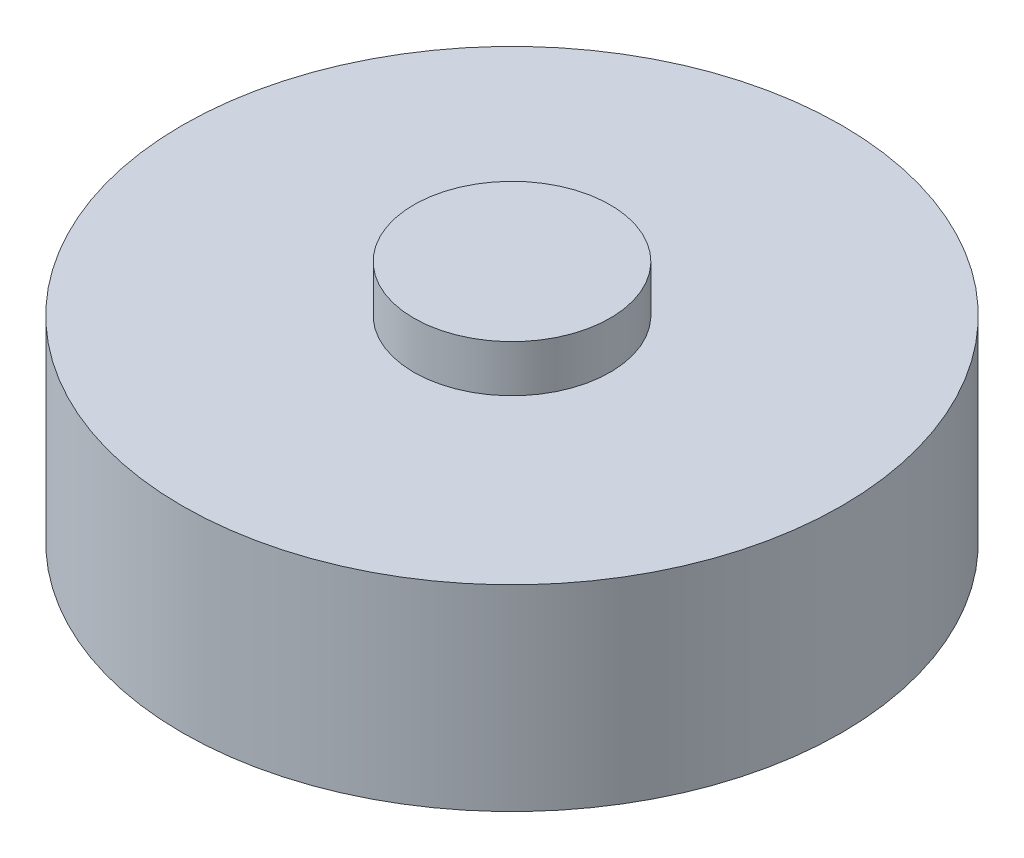
ISO-10303-21;
HEADER;
FILE_DESCRIPTION(('STEP AP214'),'2;1');
FILE_NAME('part.step','',(''),(''),'','','');
FILE_SCHEMA(('AUTOMOTIVE_DESIGN { 1 0 10303 214 1 1 1 1 }'));
ENDSEC;
DATA;
#1=APPLICATION_CONTEXT('core data for automotive mechanical design processes');
#2=APPLICATION_PROTOCOL_DEFINITION('international standard','automotive_design',2000,#1);
#3=PRODUCT_CONTEXT('',#1,'mechanical');
#4=PRODUCT('Part','Part','',(#3));
#5=PRODUCT_RELATED_PRODUCT_CATEGORY('part','',(#4));
#6=PRODUCT_DEFINITION_FORMATION('','',#4);
#7=PRODUCT_DEFINITION_CONTEXT('part definition',#1,'design');
#8=PRODUCT_DEFINITION('design','',#6,#7);
#9=PRODUCT_DEFINITION_SHAPE('','',#8);
#10=(LENGTH_UNIT() NAMED_UNIT(*) SI_UNIT(.MILLI.,.METRE.));
#11=(NAMED_UNIT(*) PLANE_ANGLE_UNIT() SI_UNIT($,.RADIAN.));
#12=(NAMED_UNIT(*) SI_UNIT($,.STERADIAN.) SOLID_ANGLE_UNIT());
#13=UNCERTAINTY_MEASURE_WITH_UNIT(LENGTH_MEASURE(1.E-05),#10,'distance_accuracy_value','');
#14=(GEOMETRIC_REPRESENTATION_CONTEXT(3) GLOBAL_UNCERTAINTY_ASSIGNED_CONTEXT((#13)) GLOBAL_UNIT_ASSIGNED_CONTEXT((#10,
#11,#12)) REPRESENTATION_CONTEXT('',''));
#15=CARTESIAN_POINT('',(0.,0.,0.));
#16=DIRECTION('',(0.,0.,1.));
#17=DIRECTION('',(1.,0.,0.));
#18=AXIS2_PLACEMENT_3D('',#15,#16,#17);
#19=CARTESIAN_POINT('',(0.,17.78,0.));
#20=DIRECTION('',(0.,-1.,0.));
#21=DIRECTION('',(0.,0.,-1.));
#22=AXIS2_PLACEMENT_3D('',#19,#20,#21);
#23=CYLINDRICAL_SURFACE('',#22,29.845);
#24=CARTESIAN_POINT('',(0.,17.78,0.));
#25=DIRECTION('',(0.,1.,0.));
#26=DIRECTION('',(0.,0.,1.));
#27=AXIS2_PLACEMENT_3D('',#24,#25,#26);
#28=CIRCLE('',#27,29.845);
#29=CARTESIAN_POINT('',(0.,17.78,29.845));
#30=VERTEX_POINT('',#29);
#31=EDGE_CURVE('E128',#30,#30,#28,.T.);
#32=ORIENTED_EDGE('',*,*,#31,.F.);
#33=EDGE_LOOP('',(#32));
#34=FACE_BOUND('',#33,.T.);
#35=CARTESIAN_POINT('',(0.,0.,0.));
#36=DIRECTION('',(0.,1.,0.));
#37=DIRECTION('',(0.,0.,1.));
#38=AXIS2_PLACEMENT_3D('',#35,#36,#37);
#39=CIRCLE('',#38,29.845);
#40=CARTESIAN_POINT('',(0.,0.,29.845));
#41=VERTEX_POINT('',#40);
#42=EDGE_CURVE('E37',#41,#41,#39,.T.);
#43=ORIENTED_EDGE('',*,*,#42,.T.);
#44=EDGE_LOOP('',(#43));
#45=FACE_BOUND('',#44,.T.);
#46=ADVANCED_FACE('F34',(#34,#45),#23,.T.);
#47=CARTESIAN_POINT('',(0.,17.78,0.));
#48=DIRECTION('',(0.,1.,0.));
#49=DIRECTION('',(0.,0.,1.));
#50=AXIS2_PLACEMENT_3D('',#47,#48,#49);
#51=PLANE('',#50);
#52=CARTESIAN_POINT('',(0.,17.78,0.));
#53=DIRECTION('',(0.,1.,0.));
#54=DIRECTION('',(0.,0.,1.));
#55=AXIS2_PLACEMENT_3D('',#52,#53,#54);
#56=CIRCLE('',#55,8.89);
#57=CARTESIAN_POINT('',(0.,17.78,8.89));
#58=VERTEX_POINT('',#57);
#59=EDGE_CURVE('E42',#58,#58,#56,.T.);
#60=ORIENTED_EDGE('',*,*,#59,.F.);
#61=EDGE_LOOP('',(#60));
#62=FACE_BOUND('',#61,.T.);
#63=ORIENTED_EDGE('',*,*,#31,.T.);
#64=EDGE_LOOP('',(#63));
#65=FACE_BOUND('',#64,.T.);
#66=ADVANCED_FACE('F139',(#62,#65),#51,.T.);
#67=CARTESIAN_POINT('',(0.,0.,0.));
#68=DIRECTION('',(0.,1.,0.));
#69=DIRECTION('',(0.,0.,1.));
#70=AXIS2_PLACEMENT_3D('',#67,#68,#69);
#71=PLANE('',#70);
#72=CARTESIAN_POINT('',(0.,0.,0.));
#73=DIRECTION('',(0.,-1.,0.));
#74=DIRECTION('',(0.,0.,-1.));
#75=AXIS2_PLACEMENT_3D('',#72,#73,#74);
#76=CIRCLE('',#75,7.493);
#77=CARTESIAN_POINT('',(0.,0.,-7.493));
#78=VERTEX_POINT('',#77);
#79=EDGE_CURVE('E11',#78,#78,#76,.T.);
#80=ORIENTED_EDGE('',*,*,#79,.F.);
#81=EDGE_LOOP('',(#80));
#82=FACE_BOUND('',#81,.T.);
#83=ORIENTED_EDGE('',*,*,#42,.F.);
#84=EDGE_LOOP('',(#83));
#85=FACE_BOUND('',#84,.T.);
#86=ADVANCED_FACE('F136',(#82,#85),#71,.F.);
#87=CARTESIAN_POINT('',(0.,22.0218,0.));
#88=DIRECTION('',(0.,-1.,0.));
#89=DIRECTION('',(0.,0.,-1.));
#90=AXIS2_PLACEMENT_3D('',#87,#88,#89);
#91=CYLINDRICAL_SURFACE('',#90,8.89);
#92=CARTESIAN_POINT('',(0.,22.0218,0.));
#93=DIRECTION('',(0.,1.,0.));
#94=DIRECTION('',(0.,0.,1.));
#95=AXIS2_PLACEMENT_3D('',#92,#93,#94);
#96=CIRCLE('',#95,8.89);
#97=CARTESIAN_POINT('',(0.,22.0218,8.89));
#98=VERTEX_POINT('',#97);
#99=EDGE_CURVE('E123',#98,#98,#96,.T.);
#100=ORIENTED_EDGE('',*,*,#99,.F.);
#101=EDGE_LOOP('',(#100));
#102=FACE_BOUND('',#101,.T.);
#103=ORIENTED_EDGE('',*,*,#59,.T.);
#104=EDGE_LOOP('',(#103));
#105=FACE_BOUND('',#104,.T.);
#106=ADVANCED_FACE('F138',(#102,#105),#91,.T.);
#107=CARTESIAN_POINT('',(0.,22.0218,0.));
#108=DIRECTION('',(0.,1.,0.));
#109=DIRECTION('',(0.,0.,1.));
#110=AXIS2_PLACEMENT_3D('',#107,#108,#109);
#111=PLANE('',#110);
#112=ORIENTED_EDGE('',*,*,#99,.T.);
#113=EDGE_LOOP('',(#112));
#114=FACE_BOUND('',#113,.T.);
#115=ADVANCED_FACE('F145',(#114),#111,.T.);
#116=CARTESIAN_POINT('',(0.,-4.064,0.));
#117=DIRECTION('',(0.,1.,0.));
#118=DIRECTION('',(0.,0.,1.));
#119=AXIS2_PLACEMENT_3D('',#116,#117,#118);
#120=CYLINDRICAL_SURFACE('',#119,7.493);
#121=CARTESIAN_POINT('',(0.,-4.064,0.));
#122=DIRECTION('',(0.,-1.,0.));
#123=DIRECTION('',(0.,0.,-1.));
#124=AXIS2_PLACEMENT_3D('',#121,#122,#123);
#125=CIRCLE('',#124,7.493);
#126=CARTESIAN_POINT('',(0.,-4.064,-7.493));
#127=VERTEX_POINT('',#126);
#128=EDGE_CURVE('E119',#127,#127,#125,.T.);
#129=ORIENTED_EDGE('',*,*,#128,.F.);
#130=EDGE_LOOP('',(#129));
#131=FACE_BOUND('',#130,.T.);
#132=ORIENTED_EDGE('',*,*,#79,.T.);
#133=EDGE_LOOP('',(#132));
#134=FACE_BOUND('',#133,.T.);
#135=ADVANCED_FACE('F189',(#131,#134),#120,.T.);
#136=CARTESIAN_POINT('',(0.,-4.826,0.));
#137=DIRECTION('',(0.,1.,0.));
#138=DIRECTION('',(0.,0.,1.));
#139=AXIS2_PLACEMENT_3D('',#136,#137,#138);
#140=CYLINDRICAL_SURFACE('',#139,8.255);
#141=CARTESIAN_POINT('',(0.,-4.826,0.));
#142=DIRECTION('',(0.,-1.,0.));
#143=DIRECTION('',(0.,0.,-1.));
#144=AXIS2_PLACEMENT_3D('',#141,#142,#143);
#145=CIRCLE('',#144,8.255);
#146=CARTESIAN_POINT('',(0.,-4.826,-8.255));
#147=VERTEX_POINT('',#146);
#148=EDGE_CURVE('E116',#147,#147,#145,.T.);
#149=ORIENTED_EDGE('',*,*,#148,.F.);
#150=EDGE_LOOP('',(#149));
#151=FACE_BOUND('',#150,.T.);
#152=CARTESIAN_POINT('',(0.,-4.064,0.));
#153=DIRECTION('',(0.,-1.,0.));
#154=DIRECTION('',(0.,0.,-1.));
#155=AXIS2_PLACEMENT_3D('',#152,#153,#154);
#156=CIRCLE('',#155,8.255);
#157=CARTESIAN_POINT('',(0.,-4.064,-8.255));
#158=VERTEX_POINT('',#157);
#159=EDGE_CURVE('E113',#158,#158,#156,.T.);
#160=ORIENTED_EDGE('',*,*,#159,.T.);
#161=EDGE_LOOP('',(#160));
#162=FACE_BOUND('',#161,.T.);
#163=ADVANCED_FACE('F178',(#151,#162),#140,.T.);
#164=CARTESIAN_POINT('',(0.,-4.826,0.));
#165=DIRECTION('',(0.,-1.,0.));
#166=DIRECTION('',(0.,0.,-1.));
#167=AXIS2_PLACEMENT_3D('',#164,#165,#166);
#168=PLANE('',#167);
#169=CARTESIAN_POINT('',(0.,-4.826,0.));
#170=DIRECTION('',(0.,-1.,0.));
#171=DIRECTION('',(0.,0.,-1.));
#172=AXIS2_PLACEMENT_3D('',#169,#170,#171);
#173=CIRCLE('',#172,2.7);
#174=CARTESIAN_POINT('',(2.33826859021798,-4.826,-1.35));
#175=VERTEX_POINT('',#174);
#176=CARTESIAN_POINT('',(2.33826859021798,-4.826,1.35));
#177=VERTEX_POINT('',#176);
#178=EDGE_CURVE('E50',#175,#177,#173,.T.);
#179=ORIENTED_EDGE('',*,*,#178,.F.);
#180=DIRECTION('',(1.,0.,0.));
#181=VECTOR('',#180,1.);
#182=CARTESIAN_POINT('',(2.33826859021798,-4.826,-1.35));
#183=LINE('',#182,#181);
#184=CARTESIAN_POINT('',(-2.33826859021798,-4.826,-1.35));
#185=VERTEX_POINT('',#184);
#186=EDGE_CURVE('E101',#185,#175,#183,.T.);
#187=ORIENTED_EDGE('',*,*,#186,.F.);
#188=CARTESIAN_POINT('',(0.,-4.826,0.));
#189=DIRECTION('',(0.,-1.,0.));
#190=DIRECTION('',(0.,0.,-1.));
#191=AXIS2_PLACEMENT_3D('',#188,#189,#190);
#192=CIRCLE('',#191,2.7);
#193=CARTESIAN_POINT('',(-2.33826859021798,-4.826,1.35));
#194=VERTEX_POINT('',#193);
#195=EDGE_CURVE('E109',#194,#185,#192,.T.);
#196=ORIENTED_EDGE('',*,*,#195,.F.);
#197=DIRECTION('',(-1.,0.,0.));
#198=VECTOR('',#197,1.);
#199=CARTESIAN_POINT('',(2.33826859021798,-4.826,1.35));
#200=LINE('',#199,#198);
#201=EDGE_CURVE('E85',#177,#194,#200,.T.);
#202=ORIENTED_EDGE('',*,*,#201,.F.);
#203=EDGE_LOOP('',(#179,#187,#196,#202));
#204=FACE_BOUND('',#203,.T.);
#205=ORIENTED_EDGE('',*,*,#148,.T.);
#206=EDGE_LOOP('',(#205));
#207=FACE_BOUND('',#206,.T.);
#208=ADVANCED_FACE('F172',(#204,#207),#168,.T.);
#209=CARTESIAN_POINT('',(0.,-4.064,0.));
#210=DIRECTION('',(0.,-1.,0.));
#211=DIRECTION('',(0.,0.,-1.));
#212=AXIS2_PLACEMENT_3D('',#209,#210,#211);
#213=PLANE('',#212);
#214=ORIENTED_EDGE('',*,*,#128,.T.);
#215=EDGE_LOOP('',(#214));
#216=FACE_BOUND('',#215,.T.);
#217=ORIENTED_EDGE('',*,*,#159,.F.);
#218=EDGE_LOOP('',(#217));
#219=FACE_BOUND('',#218,.T.);
#220=ADVANCED_FACE('F177',(#216,#219),#213,.F.);
#221=CARTESIAN_POINT('',(0.,20.574,0.));
#222=DIRECTION('',(0.,-1.,0.));
#223=DIRECTION('',(0.,0.,-1.));
#224=AXIS2_PLACEMENT_3D('',#221,#222,#223);
#225=CYLINDRICAL_SURFACE('',#224,2.7);
#226=ORIENTED_EDGE('',*,*,#178,.T.);
#227=DIRECTION('',(0.,-1.,0.));
#228=VECTOR('',#227,1.);
#229=CARTESIAN_POINT('',(2.33826859021798,20.574,1.35));
#230=LINE('',#229,#228);
#231=CARTESIAN_POINT('',(2.33826859021798,20.574,1.35));
#232=VERTEX_POINT('',#231);
#233=EDGE_CURVE('E73',#232,#177,#230,.T.);
#234=ORIENTED_EDGE('',*,*,#233,.F.);
#235=CARTESIAN_POINT('',(0.,20.574,0.));
#236=DIRECTION('',(0.,-1.,0.));
#237=DIRECTION('',(0.,0.,-1.));
#238=AXIS2_PLACEMENT_3D('',#235,#236,#237);
#239=CIRCLE('',#238,2.7);
#240=CARTESIAN_POINT('',(2.33826859021798,20.574,-1.35));
#241=VERTEX_POINT('',#240);
#242=EDGE_CURVE('E99',#241,#232,#239,.T.);
#243=ORIENTED_EDGE('',*,*,#242,.F.);
#244=DIRECTION('',(0.,-1.,0.));
#245=VECTOR('',#244,1.);
#246=CARTESIAN_POINT('',(2.33826859021798,20.574,-1.35));
#247=LINE('',#246,#245);
#248=EDGE_CURVE('E58',#241,#175,#247,.T.);
#249=ORIENTED_EDGE('',*,*,#248,.T.);
#250=EDGE_LOOP('',(#226,#234,#243,#249));
#251=FACE_BOUND('',#250,.T.);
#252=ADVANCED_FACE('F228',(#251),#225,.F.);
#253=CARTESIAN_POINT('',(2.33826859021798,20.574,-1.35));
#254=DIRECTION('',(0.,0.,-1.));
#255=DIRECTION('',(-1.,0.,0.));
#256=AXIS2_PLACEMENT_3D('',#253,#254,#255);
#257=PLANE('',#256);
#258=ORIENTED_EDGE('',*,*,#186,.T.);
#259=ORIENTED_EDGE('',*,*,#248,.F.);
#260=DIRECTION('',(1.,0.,0.));
#261=VECTOR('',#260,1.);
#262=CARTESIAN_POINT('',(2.33826859021798,20.574,-1.35));
#263=LINE('',#262,#261);
#264=CARTESIAN_POINT('',(-2.33826859021798,20.574,-1.35));
#265=VERTEX_POINT('',#264);
#266=EDGE_CURVE('E96',#265,#241,#263,.T.);
#267=ORIENTED_EDGE('',*,*,#266,.F.);
#268=DIRECTION('',(0.,-1.,0.));
#269=VECTOR('',#268,1.);
#270=CARTESIAN_POINT('',(-2.33826859021798,20.574,-1.35));
#271=LINE('',#270,#269);
#272=EDGE_CURVE('E89',#265,#185,#271,.T.);
#273=ORIENTED_EDGE('',*,*,#272,.T.);
#274=EDGE_LOOP('',(#258,#259,#267,#273));
#275=FACE_BOUND('',#274,.T.);
#276=ADVANCED_FACE('F245',(#275),#257,.F.);
#277=CARTESIAN_POINT('',(0.,20.574,0.));
#278=DIRECTION('',(0.,-1.,0.));
#279=DIRECTION('',(0.,0.,-1.));
#280=AXIS2_PLACEMENT_3D('',#277,#278,#279);
#281=CYLINDRICAL_SURFACE('',#280,2.7);
#282=ORIENTED_EDGE('',*,*,#195,.T.);
#283=ORIENTED_EDGE('',*,*,#272,.F.);
#284=CARTESIAN_POINT('',(0.,20.574,0.));
#285=DIRECTION('',(0.,-1.,0.));
#286=DIRECTION('',(0.,0.,-1.));
#287=AXIS2_PLACEMENT_3D('',#284,#285,#286);
#288=CIRCLE('',#287,2.7);
#289=CARTESIAN_POINT('',(-2.33826859021798,20.574,1.35));
#290=VERTEX_POINT('',#289);
#291=EDGE_CURVE('E92',#290,#265,#288,.T.);
#292=ORIENTED_EDGE('',*,*,#291,.F.);
#293=DIRECTION('',(0.,-1.,0.));
#294=VECTOR('',#293,1.);
#295=CARTESIAN_POINT('',(-2.33826859021798,20.574,1.35));
#296=LINE('',#295,#294);
#297=EDGE_CURVE('E78',#290,#194,#296,.T.);
#298=ORIENTED_EDGE('',*,*,#297,.T.);
#299=EDGE_LOOP('',(#282,#283,#292,#298));
#300=FACE_BOUND('',#299,.T.);
#301=ADVANCED_FACE('F93',(#300),#281,.F.);
#302=CARTESIAN_POINT('',(2.33826859021798,20.574,1.35));
#303=DIRECTION('',(0.,0.,1.));
#304=DIRECTION('',(1.,0.,0.));
#305=AXIS2_PLACEMENT_3D('',#302,#303,#304);
#306=PLANE('',#305);
#307=ORIENTED_EDGE('',*,*,#201,.T.);
#308=ORIENTED_EDGE('',*,*,#297,.F.);
#309=DIRECTION('',(-1.,0.,0.));
#310=VECTOR('',#309,1.);
#311=CARTESIAN_POINT('',(2.33826859021798,20.574,1.35));
#312=LINE('',#311,#310);
#313=EDGE_CURVE('E82',#232,#290,#312,.T.);
#314=ORIENTED_EDGE('',*,*,#313,.F.);
#315=ORIENTED_EDGE('',*,*,#233,.T.);
#316=EDGE_LOOP('',(#307,#308,#314,#315));
#317=FACE_BOUND('',#316,.T.);
#318=ADVANCED_FACE('F80',(#317),#306,.F.);
#319=CARTESIAN_POINT('',(0.,20.574,0.));
#320=DIRECTION('',(0.,-1.,0.));
#321=DIRECTION('',(0.,0.,-1.));
#322=AXIS2_PLACEMENT_3D('',#319,#320,#321);
#323=PLANE('',#322);
#324=CARTESIAN_POINT('',(0.,20.574,0.));
#325=DIRECTION('',(0.,-1.,0.));
#326=DIRECTION('',(0.,0.,-1.));
#327=AXIS2_PLACEMENT_3D('',#324,#325,#326);
#328=CIRCLE('',#327,0.949999999999999);
#329=CARTESIAN_POINT('',(0.,20.574,-0.949999999999999));
#330=VERTEX_POINT('',#329);
#331=EDGE_CURVE('E107',#330,#330,#328,.T.);
#332=ORIENTED_EDGE('',*,*,#331,.F.);
#333=EDGE_LOOP('',(#332));
#334=FACE_BOUND('',#333,.T.);
#335=ORIENTED_EDGE('',*,*,#242,.T.);
#336=ORIENTED_EDGE('',*,*,#313,.T.);
#337=ORIENTED_EDGE('',*,*,#291,.T.);
#338=ORIENTED_EDGE('',*,*,#266,.T.);
#339=EDGE_LOOP('',(#335,#336,#337,#338));
#340=FACE_BOUND('',#339,.T.);
#341=ADVANCED_FACE('F98',(#334,#340),#323,.T.);
#342=CARTESIAN_POINT('',(0.,20.574,0.));
#343=DIRECTION('',(0.,-1.,0.));
#344=DIRECTION('',(0.,0.,-1.));
#345=AXIS2_PLACEMENT_3D('',#342,#343,#344);
#346=CYLINDRICAL_SURFACE('',#345,0.949999999999999);
#347=ORIENTED_EDGE('',*,*,#331,.T.);
#348=EDGE_LOOP('',(#347));
#349=FACE_BOUND('',#348,.T.);
#350=CARTESIAN_POINT('',(0.,-4.826,0.));
#351=DIRECTION('',(0.,-1.,0.));
#352=DIRECTION('',(0.,0.,-1.));
#353=AXIS2_PLACEMENT_3D('',#350,#351,#352);
#354=CIRCLE('',#353,0.949999999999999);
#355=CARTESIAN_POINT('',(0.,-4.826,-0.949999999999999));
#356=VERTEX_POINT('',#355);
#357=EDGE_CURVE('E296',#356,#356,#354,.T.);
#358=ORIENTED_EDGE('',*,*,#357,.F.);
#359=EDGE_LOOP('',(#358));
#360=FACE_BOUND('',#359,.T.);
#361=ADVANCED_FACE('F237',(#349,#360),#346,.T.);
#362=ORIENTED_EDGE('',*,*,#357,.T.);
#363=EDGE_LOOP('',(#362));
#364=FACE_BOUND('',#363,.T.);
#365=ADVANCED_FACE('F181',(#364),#168,.T.);
#366=CLOSED_SHELL('',(#46,#66,#86,#106,#115,#135,#163,#208,#220,#252,#276,#301,#318,#341,#361,#365));
#367=MANIFOLD_SOLID_BREP('B2',#366);
#368=ADVANCED_BREP_SHAPE_REPRESENTATION('',(#18,#367),#14);
#369=SHAPE_DEFINITION_REPRESENTATION(#9,#368);
ENDSEC;
END-ISO-10303-21;
